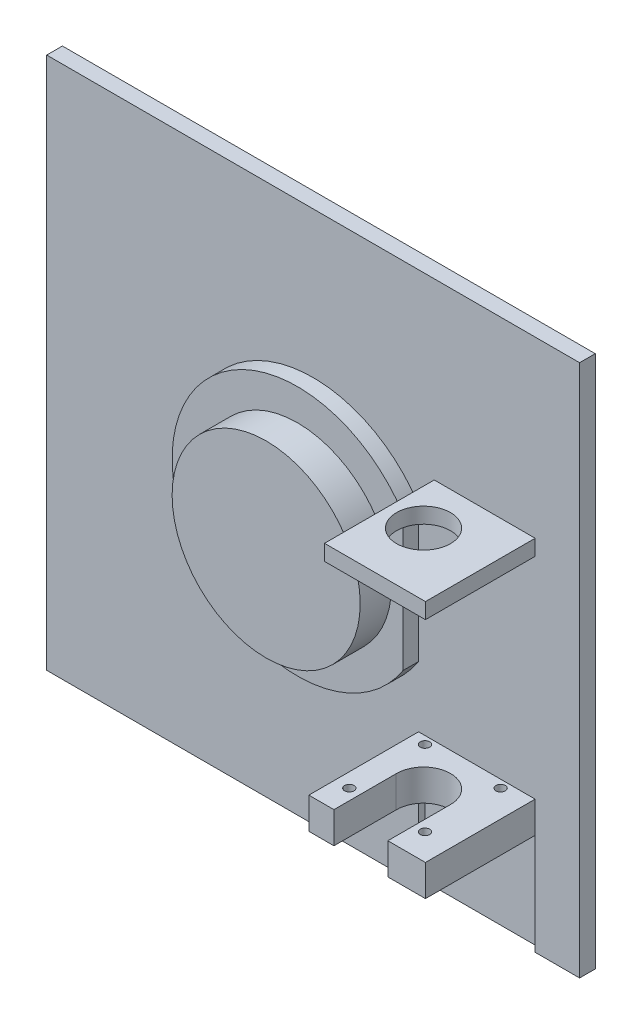
ISO-10303-21;
HEADER;
FILE_DESCRIPTION(('STEP AP214'),'2;1');
FILE_NAME('part.step','',(''),(''),'','','');
FILE_SCHEMA(('AUTOMOTIVE_DESIGN { 1 0 10303 214 1 1 1 1 }'));
ENDSEC;
DATA;
#1=APPLICATION_CONTEXT('core data for automotive mechanical design processes');
#2=APPLICATION_PROTOCOL_DEFINITION('international standard','automotive_design',2000,#1);
#3=PRODUCT_CONTEXT('',#1,'mechanical');
#4=PRODUCT('Part','Part','',(#3));
#5=PRODUCT_RELATED_PRODUCT_CATEGORY('part','',(#4));
#6=PRODUCT_DEFINITION_FORMATION('','',#4);
#7=PRODUCT_DEFINITION_CONTEXT('part definition',#1,'design');
#8=PRODUCT_DEFINITION('design','',#6,#7);
#9=PRODUCT_DEFINITION_SHAPE('','',#8);
#10=(LENGTH_UNIT() NAMED_UNIT(*) SI_UNIT(.MILLI.,.METRE.));
#11=(NAMED_UNIT(*) PLANE_ANGLE_UNIT() SI_UNIT($,.RADIAN.));
#12=(NAMED_UNIT(*) SI_UNIT($,.STERADIAN.) SOLID_ANGLE_UNIT());
#13=UNCERTAINTY_MEASURE_WITH_UNIT(LENGTH_MEASURE(1.E-05),#10,'distance_accuracy_value','');
#14=(GEOMETRIC_REPRESENTATION_CONTEXT(3) GLOBAL_UNCERTAINTY_ASSIGNED_CONTEXT((#13)) GLOBAL_UNIT_ASSIGNED_CONTEXT((#10,
#11,#12)) REPRESENTATION_CONTEXT('',''));
#15=CARTESIAN_POINT('',(0.,0.,0.));
#16=DIRECTION('',(0.,0.,1.));
#17=DIRECTION('',(1.,0.,0.));
#18=AXIS2_PLACEMENT_3D('',#15,#16,#17);
#19=CARTESIAN_POINT('',(0.,0.,12.7));
#20=DIRECTION('',(0.,0.,-1.));
#21=DIRECTION('',(-1.,0.,0.));
#22=AXIS2_PLACEMENT_3D('',#19,#20,#21);
#23=PLANE('',#22);
#24=CARTESIAN_POINT('',(107.95,105.927514246571,12.7));
#25=DIRECTION('',(0.,0.,-1.));
#26=DIRECTION('',(-1.,0.,0.));
#27=AXIS2_PLACEMENT_3D('',#24,#25,#26);
#28=CIRCLE('',#27,38.1);
#29=CARTESIAN_POINT('',(69.85,105.927514246571,12.7));
#30=VERTEX_POINT('',#29);
#31=EDGE_CURVE('E13',#30,#30,#28,.F.);
#32=ORIENTED_EDGE('',*,*,#31,.F.);
#33=EDGE_LOOP('',(#32));
#34=FACE_BOUND('',#33,.T.);
#35=CARTESIAN_POINT('',(107.95,105.927514246571,12.7));
#36=DIRECTION('',(0.,0.,1.));
#37=DIRECTION('',(1.,0.,0.));
#38=AXIS2_PLACEMENT_3D('',#35,#36,#37);
#39=CIRCLE('',#38,50.8);
#40=CARTESIAN_POINT('',(150.6474,133.451540718728,12.7));
#41=VERTEX_POINT('',#40);
#42=CARTESIAN_POINT('',(150.6474,78.4034877744141,12.7));
#43=VERTEX_POINT('',#42);
#44=EDGE_CURVE('E396',#41,#43,#39,.T.);
#45=ORIENTED_EDGE('',*,*,#44,.T.);
#46=DIRECTION('',(0.,-1.,0.));
#47=VECTOR('',#46,1.);
#48=CARTESIAN_POINT('',(150.6474,138.95324,12.7));
#49=LINE('',#48,#47);
#50=EDGE_CURVE('E231',#41,#43,#49,.T.);
#51=ORIENTED_EDGE('',*,*,#50,.F.);
#52=EDGE_LOOP('',(#45,#51));
#53=FACE_BOUND('',#52,.T.);
#54=ADVANCED_FACE('F46',(#34,#53),#23,.F.);
#55=CARTESIAN_POINT('',(0.,0.,12.7));
#56=DIRECTION('',(0.,1.,0.));
#57=DIRECTION('',(0.,0.,1.));
#58=AXIS2_PLACEMENT_3D('',#55,#56,#57);
#59=PLANE('',#58);
#60=DIRECTION('',(1.,0.,0.));
#61=VECTOR('',#60,1.);
#62=CARTESIAN_POINT('',(0.,0.,6.35));
#63=LINE('',#62,#61);
#64=CARTESIAN_POINT('',(0.,0.,6.35));
#65=VERTEX_POINT('',#64);
#66=CARTESIAN_POINT('',(150.6474,0.,6.35));
#67=VERTEX_POINT('',#66);
#68=EDGE_CURVE('E389',#65,#67,#63,.T.);
#69=ORIENTED_EDGE('',*,*,#68,.F.);
#70=DIRECTION('',(0.,0.,-1.));
#71=VECTOR('',#70,1.);
#72=CARTESIAN_POINT('',(0.,0.,12.7));
#73=LINE('',#72,#71);
#74=CARTESIAN_POINT('',(0.,0.,0.));
#75=VERTEX_POINT('',#74);
#76=EDGE_CURVE('E333',#65,#75,#73,.T.);
#77=ORIENTED_EDGE('',*,*,#76,.T.);
#78=DIRECTION('',(1.,0.,0.));
#79=VECTOR('',#78,1.);
#80=CARTESIAN_POINT('',(0.,0.,0.));
#81=LINE('',#80,#79);
#82=CARTESIAN_POINT('',(215.9,0.,0.));
#83=VERTEX_POINT('',#82);
#84=EDGE_CURVE('E318',#75,#83,#81,.T.);
#85=ORIENTED_EDGE('',*,*,#84,.T.);
#86=DIRECTION('',(0.,0.,-1.));
#87=VECTOR('',#86,1.);
#88=CARTESIAN_POINT('',(215.9,0.,12.7));
#89=LINE('',#88,#87);
#90=CARTESIAN_POINT('',(215.9,0.,6.35));
#91=VERTEX_POINT('',#90);
#92=EDGE_CURVE('E331',#91,#83,#89,.T.);
#93=ORIENTED_EDGE('',*,*,#92,.F.);
#94=DIRECTION('',(1.,0.,0.));
#95=VECTOR('',#94,1.);
#96=CARTESIAN_POINT('',(0.,0.,6.35));
#97=LINE('',#96,#95);
#98=CARTESIAN_POINT('',(197.8914,0.,6.35));
#99=VERTEX_POINT('',#98);
#100=EDGE_CURVE('E484',#99,#91,#97,.T.);
#101=ORIENTED_EDGE('',*,*,#100,.F.);
#102=DIRECTION('',(0.,0.,1.));
#103=VECTOR('',#102,1.);
#104=CARTESIAN_POINT('',(197.8914,0.,3.81));
#105=LINE('',#104,#103);
#106=CARTESIAN_POINT('',(197.8914,0.,3.81));
#107=VERTEX_POINT('',#106);
#108=EDGE_CURVE('E286',#107,#99,#105,.T.);
#109=ORIENTED_EDGE('',*,*,#108,.F.);
#110=DIRECTION('',(1.,0.,0.));
#111=VECTOR('',#110,1.);
#112=CARTESIAN_POINT('',(0.,0.,3.81));
#113=LINE('',#112,#111);
#114=CARTESIAN_POINT('',(150.6474,0.,3.81));
#115=VERTEX_POINT('',#114);
#116=EDGE_CURVE('E276',#115,#107,#113,.T.);
#117=ORIENTED_EDGE('',*,*,#116,.F.);
#118=DIRECTION('',(0.,0.,1.));
#119=VECTOR('',#118,1.);
#120=CARTESIAN_POINT('',(150.6474,0.,3.81));
#121=LINE('',#120,#119);
#122=EDGE_CURVE('E289',#115,#67,#121,.T.);
#123=ORIENTED_EDGE('',*,*,#122,.T.);
#124=EDGE_LOOP('',(#69,#77,#85,#93,#101,#109,#117,#123));
#125=FACE_BOUND('',#124,.T.);
#126=ADVANCED_FACE('F449',(#125),#59,.F.);
#127=CARTESIAN_POINT('',(0.,0.,12.7));
#128=DIRECTION('',(1.,0.,0.));
#129=DIRECTION('',(0.,0.,-1.));
#130=AXIS2_PLACEMENT_3D('',#127,#128,#129);
#131=PLANE('',#130);
#132=DIRECTION('',(0.,-1.,0.));
#133=VECTOR('',#132,1.);
#134=CARTESIAN_POINT('',(0.,0.,6.35));
#135=LINE('',#134,#133);
#136=CARTESIAN_POINT('',(0.,215.9,6.35));
#137=VERTEX_POINT('',#136);
#138=EDGE_CURVE('E392',#137,#65,#135,.T.);
#139=ORIENTED_EDGE('',*,*,#138,.F.);
#140=DIRECTION('',(0.,0.,-1.));
#141=VECTOR('',#140,1.);
#142=CARTESIAN_POINT('',(0.,215.9,12.7));
#143=LINE('',#142,#141);
#144=CARTESIAN_POINT('',(0.,215.9,0.));
#145=VERTEX_POINT('',#144);
#146=EDGE_CURVE('E327',#137,#145,#143,.T.);
#147=ORIENTED_EDGE('',*,*,#146,.T.);
#148=DIRECTION('',(0.,-1.,0.));
#149=VECTOR('',#148,1.);
#150=CARTESIAN_POINT('',(0.,0.,0.));
#151=LINE('',#150,#149);
#152=EDGE_CURVE('E315',#145,#75,#151,.T.);
#153=ORIENTED_EDGE('',*,*,#152,.T.);
#154=ORIENTED_EDGE('',*,*,#76,.F.);
#155=EDGE_LOOP('',(#139,#147,#153,#154));
#156=FACE_BOUND('',#155,.T.);
#157=ADVANCED_FACE('F48',(#156),#131,.F.);
#158=CARTESIAN_POINT('',(215.9,0.,12.7));
#159=DIRECTION('',(-1.,0.,0.));
#160=DIRECTION('',(0.,0.,1.));
#161=AXIS2_PLACEMENT_3D('',#158,#159,#160);
#162=PLANE('',#161);
#163=DIRECTION('',(0.,1.,0.));
#164=VECTOR('',#163,1.);
#165=CARTESIAN_POINT('',(215.9,0.,6.35));
#166=LINE('',#165,#164);
#167=CARTESIAN_POINT('',(215.9,215.9,6.35));
#168=VERTEX_POINT('',#167);
#169=EDGE_CURVE('E486',#91,#168,#166,.T.);
#170=ORIENTED_EDGE('',*,*,#169,.F.);
#171=ORIENTED_EDGE('',*,*,#92,.T.);
#172=DIRECTION('',(0.,1.,0.));
#173=VECTOR('',#172,1.);
#174=CARTESIAN_POINT('',(215.9,0.,0.));
#175=LINE('',#174,#173);
#176=CARTESIAN_POINT('',(215.9,215.9,0.));
#177=VERTEX_POINT('',#176);
#178=EDGE_CURVE('E321',#83,#177,#175,.T.);
#179=ORIENTED_EDGE('',*,*,#178,.T.);
#180=DIRECTION('',(0.,0.,-1.));
#181=VECTOR('',#180,1.);
#182=CARTESIAN_POINT('',(215.9,215.9,12.7));
#183=LINE('',#182,#181);
#184=EDGE_CURVE('E329',#168,#177,#183,.T.);
#185=ORIENTED_EDGE('',*,*,#184,.F.);
#186=EDGE_LOOP('',(#170,#171,#179,#185));
#187=FACE_BOUND('',#186,.T.);
#188=ADVANCED_FACE('F505',(#187),#162,.F.);
#189=CARTESIAN_POINT('',(0.,215.9,12.7));
#190=DIRECTION('',(0.,-1.,0.));
#191=DIRECTION('',(0.,0.,-1.));
#192=AXIS2_PLACEMENT_3D('',#189,#190,#191);
#193=PLANE('',#192);
#194=DIRECTION('',(-1.,0.,0.));
#195=VECTOR('',#194,1.);
#196=CARTESIAN_POINT('',(0.,215.9,6.35));
#197=LINE('',#196,#195);
#198=EDGE_CURVE('E488',#168,#137,#197,.T.);
#199=ORIENTED_EDGE('',*,*,#198,.F.);
#200=ORIENTED_EDGE('',*,*,#184,.T.);
#201=DIRECTION('',(-1.,0.,0.));
#202=VECTOR('',#201,1.);
#203=CARTESIAN_POINT('',(0.,215.9,0.));
#204=LINE('',#203,#202);
#205=EDGE_CURVE('E324',#177,#145,#204,.T.);
#206=ORIENTED_EDGE('',*,*,#205,.T.);
#207=ORIENTED_EDGE('',*,*,#146,.F.);
#208=EDGE_LOOP('',(#199,#200,#206,#207));
#209=FACE_BOUND('',#208,.T.);
#210=ADVANCED_FACE('F508',(#209),#193,.F.);
#211=CARTESIAN_POINT('',(197.8914,0.,3.81));
#212=DIRECTION('',(-1.,0.,0.));
#213=DIRECTION('',(0.,0.,1.));
#214=AXIS2_PLACEMENT_3D('',#211,#212,#213);
#215=PLANE('',#214);
#216=ORIENTED_EDGE('',*,*,#108,.T.);
#217=DIRECTION('',(0.,-1.,0.));
#218=VECTOR('',#217,1.);
#219=CARTESIAN_POINT('',(197.8914,0.,6.35));
#220=LINE('',#219,#218);
#221=CARTESIAN_POINT('',(197.8914,41.0616399999998,6.35));
#222=VERTEX_POINT('',#221);
#223=EDGE_CURVE('E385',#222,#99,#220,.T.);
#224=ORIENTED_EDGE('',*,*,#223,.F.);
#225=DIRECTION('',(0.,0.,1.));
#226=VECTOR('',#225,1.);
#227=CARTESIAN_POINT('',(197.8914,41.0616399999998,3.81));
#228=LINE('',#227,#226);
#229=CARTESIAN_POINT('',(197.8914,41.0616399999998,3.81));
#230=VERTEX_POINT('',#229);
#231=EDGE_CURVE('E282',#230,#222,#228,.T.);
#232=ORIENTED_EDGE('',*,*,#231,.F.);
#233=DIRECTION('',(0.,-1.,0.));
#234=VECTOR('',#233,1.);
#235=CARTESIAN_POINT('',(197.8914,0.,3.81));
#236=LINE('',#235,#234);
#237=EDGE_CURVE('E279',#230,#107,#236,.T.);
#238=ORIENTED_EDGE('',*,*,#237,.T.);
#239=EDGE_LOOP('',(#216,#224,#232,#238));
#240=FACE_BOUND('',#239,.T.);
#241=ADVANCED_FACE('F510',(#240),#215,.T.);
#242=CARTESIAN_POINT('',(150.6474,0.,3.81));
#243=DIRECTION('',(-1.,0.,0.));
#244=DIRECTION('',(0.,0.,1.));
#245=AXIS2_PLACEMENT_3D('',#242,#243,#244);
#246=PLANE('',#245);
#247=DIRECTION('',(0.,1.,0.));
#248=VECTOR('',#247,1.);
#249=CARTESIAN_POINT('',(150.6474,0.,6.35));
#250=LINE('',#249,#248);
#251=CARTESIAN_POINT('',(150.6474,41.0616399999998,6.35));
#252=VERTEX_POINT('',#251);
#253=EDGE_CURVE('E388',#67,#252,#250,.T.);
#254=ORIENTED_EDGE('',*,*,#253,.F.);
#255=ORIENTED_EDGE('',*,*,#122,.F.);
#256=DIRECTION('',(0.,-1.,0.));
#257=VECTOR('',#256,1.);
#258=CARTESIAN_POINT('',(150.6474,0.,3.81));
#259=LINE('',#258,#257);
#260=CARTESIAN_POINT('',(150.6474,41.0616399999998,3.81));
#261=VERTEX_POINT('',#260);
#262=EDGE_CURVE('E273',#261,#115,#259,.T.);
#263=ORIENTED_EDGE('',*,*,#262,.F.);
#264=DIRECTION('',(0.,0.,1.));
#265=VECTOR('',#264,1.);
#266=CARTESIAN_POINT('',(150.6474,41.0616399999998,3.81));
#267=LINE('',#266,#265);
#268=EDGE_CURVE('E281',#261,#252,#267,.T.);
#269=ORIENTED_EDGE('',*,*,#268,.T.);
#270=EDGE_LOOP('',(#254,#255,#263,#269));
#271=FACE_BOUND('',#270,.T.);
#272=ADVANCED_FACE('F516',(#271),#246,.F.);
#273=CARTESIAN_POINT('',(150.6474,138.95324,6.35));
#274=DIRECTION('',(-1.,0.,0.));
#275=DIRECTION('',(0.,0.,1.));
#276=AXIS2_PLACEMENT_3D('',#273,#274,#275);
#277=PLANE('',#276);
#278=DIRECTION('',(0.,0.,1.));
#279=VECTOR('',#278,1.);
#280=CARTESIAN_POINT('',(150.6474,78.4034877744141,6.35));
#281=LINE('',#280,#279);
#282=CARTESIAN_POINT('',(150.6474,78.4034877744141,6.35));
#283=VERTEX_POINT('',#282);
#284=EDGE_CURVE('E401',#283,#43,#281,.T.);
#285=ORIENTED_EDGE('',*,*,#284,.F.);
#286=DIRECTION('',(0.,-1.,0.));
#287=VECTOR('',#286,1.);
#288=CARTESIAN_POINT('',(150.6474,138.95324,6.35));
#289=LINE('',#288,#287);
#290=CARTESIAN_POINT('',(150.6474,133.451540718728,6.35));
#291=VERTEX_POINT('',#290);
#292=EDGE_CURVE('E227',#291,#283,#289,.T.);
#293=ORIENTED_EDGE('',*,*,#292,.F.);
#294=DIRECTION('',(0.,0.,1.));
#295=VECTOR('',#294,1.);
#296=CARTESIAN_POINT('',(150.6474,133.451540718728,6.35));
#297=LINE('',#296,#295);
#298=EDGE_CURVE('E391',#291,#41,#297,.T.);
#299=ORIENTED_EDGE('',*,*,#298,.T.);
#300=ORIENTED_EDGE('',*,*,#50,.T.);
#301=EDGE_LOOP('',(#285,#293,#299,#300));
#302=FACE_BOUND('',#301,.T.);
#303=ADVANCED_FACE('F443',(#302),#277,.F.);
#304=CARTESIAN_POINT('',(0.,0.,50.8));
#305=DIRECTION('',(0.,0.,1.));
#306=DIRECTION('',(1.,0.,0.));
#307=AXIS2_PLACEMENT_3D('',#304,#305,#306);
#308=PLANE('',#307);
#309=DIRECTION('',(0.,-1.,0.));
#310=VECTOR('',#309,1.);
#311=CARTESIAN_POINT('',(160.812004433932,79.1616399999998,50.8));
#312=LINE('',#311,#310);
#313=CARTESIAN_POINT('',(160.812004433932,53.7616399999999,50.8));
#314=VERTEX_POINT('',#313);
#315=CARTESIAN_POINT('',(160.812004433932,41.0616399999998,50.8));
#316=VERTEX_POINT('',#315);
#317=EDGE_CURVE('E240',#314,#316,#312,.T.);
#318=ORIENTED_EDGE('',*,*,#317,.F.);
#319=DIRECTION('',(1.,0.,0.));
#320=VECTOR('',#319,1.);
#321=CARTESIAN_POINT('',(150.6474,53.7616399999998,50.8));
#322=LINE('',#321,#320);
#323=CARTESIAN_POINT('',(150.6474,53.7616399999998,50.8));
#324=VERTEX_POINT('',#323);
#325=EDGE_CURVE('E301',#324,#314,#322,.T.);
#326=ORIENTED_EDGE('',*,*,#325,.F.);
#327=DIRECTION('',(0.,1.,0.));
#328=VECTOR('',#327,1.);
#329=CARTESIAN_POINT('',(150.6474,41.0616399999998,50.8));
#330=LINE('',#329,#328);
#331=CARTESIAN_POINT('',(150.6474,41.0616399999998,50.8));
#332=VERTEX_POINT('',#331);
#333=EDGE_CURVE('E304',#332,#324,#330,.T.);
#334=ORIENTED_EDGE('',*,*,#333,.F.);
#335=DIRECTION('',(1.,0.,0.));
#336=VECTOR('',#335,1.);
#337=CARTESIAN_POINT('',(174.2694,41.0616399999998,50.8));
#338=LINE('',#337,#336);
#339=EDGE_CURVE('E294',#332,#316,#338,.T.);
#340=ORIENTED_EDGE('',*,*,#339,.T.);
#341=EDGE_LOOP('',(#318,#326,#334,#340));
#342=FACE_BOUND('',#341,.T.);
#343=ADVANCED_FACE('F356',(#342),#308,.T.);
#344=DIRECTION('',(0.,-1.,0.));
#345=VECTOR('',#344,1.);
#346=CARTESIAN_POINT('',(156.9974,145.30324,12.7));
#347=LINE('',#346,#345);
#348=CARTESIAN_POINT('',(156.9974,145.30324,12.7));
#349=VERTEX_POINT('',#348);
#350=CARTESIAN_POINT('',(156.9974,138.95324,12.7));
#351=VERTEX_POINT('',#350);
#352=EDGE_CURVE('E435',#349,#351,#347,.T.);
#353=ORIENTED_EDGE('',*,*,#352,.F.);
#354=DIRECTION('',(0.707106781186549,0.707106781186546,0.));
#355=VECTOR('',#354,1.);
#356=CARTESIAN_POINT('',(5.84707999999969,-5.84707999999972,12.7));
#357=LINE('',#356,#355);
#358=CARTESIAN_POINT('',(150.6474,138.95324,12.7));
#359=VERTEX_POINT('',#358);
#360=EDGE_CURVE('E399',#359,#349,#357,.T.);
#361=ORIENTED_EDGE('',*,*,#360,.F.);
#362=DIRECTION('',(-1.,0.,0.));
#363=VECTOR('',#362,1.);
#364=CARTESIAN_POINT('',(156.9974,138.95324,12.7));
#365=LINE('',#364,#363);
#366=EDGE_CURVE('E217',#351,#359,#365,.T.);
#367=ORIENTED_EDGE('',*,*,#366,.F.);
#368=EDGE_LOOP('',(#353,#361,#367));
#369=FACE_BOUND('',#368,.T.);
#370=ADVANCED_FACE('F452',(#369),#23,.F.);
#371=CARTESIAN_POINT('',(0.,0.,0.));
#372=DIRECTION('',(0.,0.,-1.));
#373=DIRECTION('',(-1.,0.,0.));
#374=AXIS2_PLACEMENT_3D('',#371,#372,#373);
#375=PLANE('',#374);
#376=ORIENTED_EDGE('',*,*,#152,.F.);
#377=ORIENTED_EDGE('',*,*,#205,.F.);
#378=ORIENTED_EDGE('',*,*,#178,.F.);
#379=ORIENTED_EDGE('',*,*,#84,.F.);
#380=EDGE_LOOP('',(#376,#377,#378,#379));
#381=FACE_BOUND('',#380,.T.);
#382=ADVANCED_FACE('F461',(#381),#375,.T.);
#383=CARTESIAN_POINT('',(197.8914,41.0616399999999,50.8));
#384=DIRECTION('',(-1.,0.,0.));
#385=DIRECTION('',(0.,-1.,0.));
#386=AXIS2_PLACEMENT_3D('',#383,#384,#385);
#387=PLANE('',#386);
#388=DIRECTION('',(0.,0.,-1.));
#389=VECTOR('',#388,1.);
#390=CARTESIAN_POINT('',(197.8914,41.0616399999999,50.8));
#391=LINE('',#390,#389);
#392=CARTESIAN_POINT('',(197.8914,41.0616399999999,50.8));
#393=VERTEX_POINT('',#392);
#394=EDGE_CURVE('E313',#393,#222,#391,.T.);
#395=ORIENTED_EDGE('',*,*,#394,.T.);
#396=CARTESIAN_POINT('',(197.8914,53.7616399999999,6.35));
#397=VERTEX_POINT('',#396);
#398=EDGE_CURVE('E381',#397,#222,#220,.T.);
#399=ORIENTED_EDGE('',*,*,#398,.F.);
#400=DIRECTION('',(0.,0.,-1.));
#401=VECTOR('',#400,1.);
#402=CARTESIAN_POINT('',(197.8914,53.7616399999999,50.8));
#403=LINE('',#402,#401);
#404=CARTESIAN_POINT('',(197.8914,53.7616399999999,50.8));
#405=VERTEX_POINT('',#404);
#406=EDGE_CURVE('E311',#405,#397,#403,.T.);
#407=ORIENTED_EDGE('',*,*,#406,.F.);
#408=DIRECTION('',(0.,1.,0.));
#409=VECTOR('',#408,1.);
#410=CARTESIAN_POINT('',(197.8914,41.0616399999999,50.8));
#411=LINE('',#410,#409);
#412=EDGE_CURVE('E297',#393,#405,#411,.T.);
#413=ORIENTED_EDGE('',*,*,#412,.F.);
#414=EDGE_LOOP('',(#395,#399,#407,#413));
#415=FACE_BOUND('',#414,.T.);
#416=ADVANCED_FACE('F382',(#415),#387,.F.);
#417=CARTESIAN_POINT('',(150.6474,53.7616399999998,50.8));
#418=DIRECTION('',(0.,1.,0.));
#419=DIRECTION('',(-1.,0.,0.));
#420=AXIS2_PLACEMENT_3D('',#417,#418,#419);
#421=PLANE('',#420);
#422=CARTESIAN_POINT('',(187.059676396203,53.7616399999998,40.1562237012513));
#423=DIRECTION('',(0.,-1.,0.));
#424=DIRECTION('',(0.,0.,-1.));
#425=AXIS2_PLACEMENT_3D('',#422,#423,#424);
#426=CIRCLE('',#425,1.90499999999999);
#427=CARTESIAN_POINT('',(187.059676396203,53.7616399999998,38.2512237012513));
#428=VERTEX_POINT('',#427);
#429=EDGE_CURVE('E413',#428,#428,#426,.T.);
#430=ORIENTED_EDGE('',*,*,#429,.T.);
#431=EDGE_LOOP('',(#430));
#432=FACE_BOUND('',#431,.T.);
#433=CARTESIAN_POINT('',(156.401876396203,53.7616399999998,9.49842370125133));
#434=DIRECTION('',(0.,-1.,0.));
#435=DIRECTION('',(0.,0.,-1.));
#436=AXIS2_PLACEMENT_3D('',#433,#434,#435);
#437=CIRCLE('',#436,1.90499999999999);
#438=CARTESIAN_POINT('',(156.401876396203,53.7616399999998,7.59342370125134));
#439=VERTEX_POINT('',#438);
#440=EDGE_CURVE('E420',#439,#439,#437,.T.);
#441=ORIENTED_EDGE('',*,*,#440,.T.);
#442=EDGE_LOOP('',(#441));
#443=FACE_BOUND('',#442,.T.);
#444=CARTESIAN_POINT('',(187.059676396203,53.7616399999998,9.49842370125133));
#445=DIRECTION('',(0.,-1.,0.));
#446=DIRECTION('',(0.,0.,-1.));
#447=AXIS2_PLACEMENT_3D('',#444,#445,#446);
#448=CIRCLE('',#447,1.90499999999999);
#449=CARTESIAN_POINT('',(187.059676396203,53.7616399999998,7.59342370125133));
#450=VERTEX_POINT('',#449);
#451=EDGE_CURVE('E407',#450,#450,#448,.T.);
#452=ORIENTED_EDGE('',*,*,#451,.T.);
#453=EDGE_LOOP('',(#452));
#454=FACE_BOUND('',#453,.T.);
#455=CARTESIAN_POINT('',(156.401876396203,53.7616399999998,40.1562237012513));
#456=DIRECTION('',(0.,-1.,0.));
#457=DIRECTION('',(0.,0.,-1.));
#458=AXIS2_PLACEMENT_3D('',#455,#456,#457);
#459=CIRCLE('',#458,1.90499999999999);
#460=CARTESIAN_POINT('',(156.401876396203,53.7616399999998,38.2512237012513));
#461=VERTEX_POINT('',#460);
#462=EDGE_CURVE('E425',#461,#461,#459,.T.);
#463=ORIENTED_EDGE('',*,*,#462,.T.);
#464=EDGE_LOOP('',(#463));
#465=FACE_BOUND('',#464,.T.);
#466=DIRECTION('',(0.,0.,1.));
#467=VECTOR('',#466,1.);
#468=CARTESIAN_POINT('',(160.812004433932,53.7616399999999,50.8));
#469=LINE('',#468,#467);
#470=CARTESIAN_POINT('',(160.812004433932,53.7616399999998,25.6770474025024));
#471=VERTEX_POINT('',#470);
#472=EDGE_CURVE('E246',#471,#314,#469,.T.);
#473=ORIENTED_EDGE('',*,*,#472,.F.);
#474=CARTESIAN_POINT('',(171.730776396203,53.7616399999999,25.4115237012513));
#475=DIRECTION('',(0.,1.,0.));
#476=DIRECTION('',(-1.,0.,0.));
#477=AXIS2_PLACEMENT_3D('',#474,#475,#476);
#478=CIRCLE('',#477,10.922);
#479=CARTESIAN_POINT('',(182.649548358474,53.7616399999999,25.6770474025024));
#480=VERTEX_POINT('',#479);
#481=EDGE_CURVE('E255',#480,#471,#478,.T.);
#482=ORIENTED_EDGE('',*,*,#481,.F.);
#483=DIRECTION('',(0.,0.,-1.));
#484=VECTOR('',#483,1.);
#485=CARTESIAN_POINT('',(182.649548358474,53.7616399999999,50.8));
#486=LINE('',#485,#484);
#487=CARTESIAN_POINT('',(182.649548358474,53.7616399999999,50.8));
#488=VERTEX_POINT('',#487);
#489=EDGE_CURVE('E242',#488,#480,#486,.T.);
#490=ORIENTED_EDGE('',*,*,#489,.F.);
#491=EDGE_CURVE('E300',#488,#405,#322,.T.);
#492=ORIENTED_EDGE('',*,*,#491,.T.);
#493=ORIENTED_EDGE('',*,*,#406,.T.);
#494=DIRECTION('',(1.,0.,0.));
#495=VECTOR('',#494,1.);
#496=CARTESIAN_POINT('',(150.6474,53.7616399999999,6.35));
#497=LINE('',#496,#495);
#498=CARTESIAN_POINT('',(150.6474,53.7616399999999,6.35));
#499=VERTEX_POINT('',#498);
#500=EDGE_CURVE('E224',#499,#397,#497,.T.);
#501=ORIENTED_EDGE('',*,*,#500,.F.);
#502=DIRECTION('',(0.,0.,-1.));
#503=VECTOR('',#502,1.);
#504=CARTESIAN_POINT('',(150.6474,53.7616399999998,50.8));
#505=LINE('',#504,#503);
#506=EDGE_CURVE('E309',#324,#499,#505,.T.);
#507=ORIENTED_EDGE('',*,*,#506,.F.);
#508=ORIENTED_EDGE('',*,*,#325,.T.);
#509=EDGE_LOOP('',(#473,#482,#490,#492,#493,#501,#507,#508));
#510=FACE_BOUND('',#509,.T.);
#511=ADVANCED_FACE('F350',(#432,#443,#454,#465,#510),#421,.T.);
#512=CARTESIAN_POINT('',(150.6474,41.0616399999998,50.8));
#513=DIRECTION('',(-1.,0.,0.));
#514=DIRECTION('',(0.,-1.,0.));
#515=AXIS2_PLACEMENT_3D('',#512,#513,#514);
#516=PLANE('',#515);
#517=ORIENTED_EDGE('',*,*,#506,.T.);
#518=EDGE_CURVE('E362',#252,#499,#250,.T.);
#519=ORIENTED_EDGE('',*,*,#518,.F.);
#520=DIRECTION('',(0.,0.,-1.));
#521=VECTOR('',#520,1.);
#522=CARTESIAN_POINT('',(150.6474,41.0616399999998,50.8));
#523=LINE('',#522,#521);
#524=EDGE_CURVE('E307',#332,#252,#523,.T.);
#525=ORIENTED_EDGE('',*,*,#524,.F.);
#526=ORIENTED_EDGE('',*,*,#333,.T.);
#527=EDGE_LOOP('',(#517,#519,#525,#526));
#528=FACE_BOUND('',#527,.T.);
#529=ADVANCED_FACE('F359',(#528),#516,.T.);
#530=CARTESIAN_POINT('',(174.2694,41.0616399999998,50.8));
#531=DIRECTION('',(0.,-1.,0.));
#532=DIRECTION('',(0.,0.,-1.));
#533=AXIS2_PLACEMENT_3D('',#530,#531,#532);
#534=PLANE('',#533);
#535=CARTESIAN_POINT('',(187.059676396203,41.0616399999998,40.1562237012513));
#536=DIRECTION('',(0.,-1.,0.));
#537=DIRECTION('',(0.,0.,-1.));
#538=AXIS2_PLACEMENT_3D('',#535,#536,#537);
#539=CIRCLE('',#538,1.90499999999999);
#540=CARTESIAN_POINT('',(187.059676396203,41.0616399999998,38.2512237012513));
#541=VERTEX_POINT('',#540);
#542=EDGE_CURVE('E417',#541,#541,#539,.T.);
#543=ORIENTED_EDGE('',*,*,#542,.F.);
#544=EDGE_LOOP('',(#543));
#545=FACE_BOUND('',#544,.T.);
#546=CARTESIAN_POINT('',(156.401876396203,41.0616399999998,9.49842370125133));
#547=DIRECTION('',(0.,-1.,0.));
#548=DIRECTION('',(0.,0.,-1.));
#549=AXIS2_PLACEMENT_3D('',#546,#547,#548);
#550=CIRCLE('',#549,1.90499999999999);
#551=CARTESIAN_POINT('',(156.401876396203,41.0616399999998,7.59342370125134));
#552=VERTEX_POINT('',#551);
#553=EDGE_CURVE('E410',#552,#552,#550,.T.);
#554=ORIENTED_EDGE('',*,*,#553,.F.);
#555=EDGE_LOOP('',(#554));
#556=FACE_BOUND('',#555,.T.);
#557=CARTESIAN_POINT('',(187.059676396203,41.0616399999998,9.49842370125133));
#558=DIRECTION('',(0.,-1.,0.));
#559=DIRECTION('',(0.,0.,-1.));
#560=AXIS2_PLACEMENT_3D('',#557,#558,#559);
#561=CIRCLE('',#560,1.90499999999999);
#562=CARTESIAN_POINT('',(187.059676396203,41.0616399999998,7.59342370125133));
#563=VERTEX_POINT('',#562);
#564=EDGE_CURVE('E403',#563,#563,#561,.T.);
#565=ORIENTED_EDGE('',*,*,#564,.F.);
#566=EDGE_LOOP('',(#565));
#567=FACE_BOUND('',#566,.T.);
#568=CARTESIAN_POINT('',(156.401876396203,41.0616399999998,40.1562237012513));
#569=DIRECTION('',(0.,-1.,0.));
#570=DIRECTION('',(0.,0.,-1.));
#571=AXIS2_PLACEMENT_3D('',#568,#569,#570);
#572=CIRCLE('',#571,1.90499999999999);
#573=CARTESIAN_POINT('',(156.401876396203,41.0616399999998,38.2512237012513));
#574=VERTEX_POINT('',#573);
#575=EDGE_CURVE('E416',#574,#574,#572,.T.);
#576=ORIENTED_EDGE('',*,*,#575,.F.);
#577=EDGE_LOOP('',(#576));
#578=FACE_BOUND('',#577,.T.);
#579=DIRECTION('',(0.,0.,-1.));
#580=VECTOR('',#579,1.);
#581=CARTESIAN_POINT('',(160.812004433932,41.0616399999998,25.146));
#582=LINE('',#581,#580);
#583=CARTESIAN_POINT('',(160.812004433932,41.0616399999998,25.6770474025024));
#584=VERTEX_POINT('',#583);
#585=EDGE_CURVE('E236',#316,#584,#582,.T.);
#586=ORIENTED_EDGE('',*,*,#585,.F.);
#587=ORIENTED_EDGE('',*,*,#339,.F.);
#588=ORIENTED_EDGE('',*,*,#524,.T.);
#589=ORIENTED_EDGE('',*,*,#268,.F.);
#590=DIRECTION('',(-1.,0.,0.));
#591=VECTOR('',#590,1.);
#592=CARTESIAN_POINT('',(0.,41.0616399999998,3.81));
#593=LINE('',#592,#591);
#594=EDGE_CURVE('E270',#230,#261,#593,.T.);
#595=ORIENTED_EDGE('',*,*,#594,.F.);
#596=ORIENTED_EDGE('',*,*,#231,.T.);
#597=ORIENTED_EDGE('',*,*,#394,.F.);
#598=CARTESIAN_POINT('',(182.649548358474,41.0616399999998,50.8));
#599=VERTEX_POINT('',#598);
#600=EDGE_CURVE('E285',#599,#393,#338,.T.);
#601=ORIENTED_EDGE('',*,*,#600,.F.);
#602=DIRECTION('',(0.,0.,1.));
#603=VECTOR('',#602,1.);
#604=CARTESIAN_POINT('',(182.649548358474,41.0616399999998,25.146));
#605=LINE('',#604,#603);
#606=CARTESIAN_POINT('',(182.649548358474,41.0616399999998,25.6770474025024));
#607=VERTEX_POINT('',#606);
#608=EDGE_CURVE('E218',#607,#599,#605,.T.);
#609=ORIENTED_EDGE('',*,*,#608,.F.);
#610=CARTESIAN_POINT('',(171.730776396203,41.0616399999998,25.4115237012513));
#611=DIRECTION('',(0.,-1.,0.));
#612=DIRECTION('',(0.,0.,-1.));
#613=AXIS2_PLACEMENT_3D('',#610,#611,#612);
#614=CIRCLE('',#613,10.922);
#615=EDGE_CURVE('E248',#584,#607,#614,.T.);
#616=ORIENTED_EDGE('',*,*,#615,.F.);
#617=EDGE_LOOP('',(#586,#587,#588,#589,#595,#596,#597,#601,#609,#616));
#618=FACE_BOUND('',#617,.T.);
#619=ADVANCED_FACE('F365',(#545,#556,#567,#578,#618),#534,.T.);
#620=DIRECTION('',(0.,-1.,0.));
#621=VECTOR('',#620,1.);
#622=CARTESIAN_POINT('',(182.649548358474,79.1616399999998,50.8));
#623=LINE('',#622,#621);
#624=EDGE_CURVE('E239',#488,#599,#623,.T.);
#625=ORIENTED_EDGE('',*,*,#624,.T.);
#626=ORIENTED_EDGE('',*,*,#600,.T.);
#627=ORIENTED_EDGE('',*,*,#412,.T.);
#628=ORIENTED_EDGE('',*,*,#491,.F.);
#629=EDGE_LOOP('',(#625,#626,#627,#628));
#630=FACE_BOUND('',#629,.T.);
#631=ADVANCED_FACE('F375',(#630),#308,.T.);
#632=CARTESIAN_POINT('',(0.,0.,3.81));
#633=DIRECTION('',(0.,0.,1.));
#634=DIRECTION('',(1.,0.,0.));
#635=AXIS2_PLACEMENT_3D('',#632,#633,#634);
#636=PLANE('',#635);
#637=ORIENTED_EDGE('',*,*,#594,.T.);
#638=ORIENTED_EDGE('',*,*,#262,.T.);
#639=ORIENTED_EDGE('',*,*,#116,.T.);
#640=ORIENTED_EDGE('',*,*,#237,.F.);
#641=EDGE_LOOP('',(#637,#638,#639,#640));
#642=FACE_BOUND('',#641,.T.);
#643=ADVANCED_FACE('F651',(#642),#636,.T.);
#644=CARTESIAN_POINT('',(197.8914,0.,50.8));
#645=DIRECTION('',(-1.,0.,0.));
#646=DIRECTION('',(0.,0.,1.));
#647=AXIS2_PLACEMENT_3D('',#644,#645,#646);
#648=PLANE('',#647);
#649=DIRECTION('',(0.,0.,-1.));
#650=VECTOR('',#649,1.);
#651=CARTESIAN_POINT('',(197.8914,138.95324,50.8));
#652=LINE('',#651,#650);
#653=CARTESIAN_POINT('',(197.8914,138.95324,50.8));
#654=VERTEX_POINT('',#653);
#655=CARTESIAN_POINT('',(197.8914,138.95324,6.35));
#656=VERTEX_POINT('',#655);
#657=EDGE_CURVE('E266',#654,#656,#652,.T.);
#658=ORIENTED_EDGE('',*,*,#657,.T.);
#659=CARTESIAN_POINT('',(197.8914,145.30324,6.35));
#660=VERTEX_POINT('',#659);
#661=EDGE_CURVE('E223',#660,#656,#220,.T.);
#662=ORIENTED_EDGE('',*,*,#661,.F.);
#663=DIRECTION('',(0.,0.,-1.));
#664=VECTOR('',#663,1.);
#665=CARTESIAN_POINT('',(197.8914,145.30324,50.8));
#666=LINE('',#665,#664);
#667=CARTESIAN_POINT('',(197.8914,145.30324,50.8));
#668=VERTEX_POINT('',#667);
#669=EDGE_CURVE('E268',#668,#660,#666,.T.);
#670=ORIENTED_EDGE('',*,*,#669,.F.);
#671=DIRECTION('',(0.,1.,0.));
#672=VECTOR('',#671,1.);
#673=CARTESIAN_POINT('',(197.8914,0.,50.8));
#674=LINE('',#673,#672);
#675=EDGE_CURVE('E257',#654,#668,#674,.T.);
#676=ORIENTED_EDGE('',*,*,#675,.F.);
#677=EDGE_LOOP('',(#658,#662,#670,#676));
#678=FACE_BOUND('',#677,.T.);
#679=ADVANCED_FACE('F480',(#678),#648,.F.);
#680=CARTESIAN_POINT('',(0.,145.30324,50.8));
#681=DIRECTION('',(0.,-1.,0.));
#682=DIRECTION('',(0.,0.,-1.));
#683=AXIS2_PLACEMENT_3D('',#680,#681,#682);
#684=PLANE('',#683);
#685=CARTESIAN_POINT('',(171.730776396203,145.30324,25.4115237012513));
#686=DIRECTION('',(0.,-1.,0.));
#687=DIRECTION('',(0.,0.,-1.));
#688=AXIS2_PLACEMENT_3D('',#685,#686,#687);
#689=CIRCLE('',#688,10.922);
#690=CARTESIAN_POINT('',(171.730776396203,145.30324,14.4895237012513));
#691=VERTEX_POINT('',#690);
#692=EDGE_CURVE('E252',#691,#691,#689,.T.);
#693=ORIENTED_EDGE('',*,*,#692,.T.);
#694=EDGE_LOOP('',(#693));
#695=FACE_BOUND('',#694,.T.);
#696=ORIENTED_EDGE('',*,*,#669,.T.);
#697=DIRECTION('',(1.,0.,0.));
#698=VECTOR('',#697,1.);
#699=CARTESIAN_POINT('',(0.,145.30324,6.35));
#700=LINE('',#699,#698);
#701=CARTESIAN_POINT('',(156.9974,145.30324,6.35));
#702=VERTEX_POINT('',#701);
#703=EDGE_CURVE('E209',#702,#660,#700,.T.);
#704=ORIENTED_EDGE('',*,*,#703,.F.);
#705=DIRECTION('',(0.,0.,1.));
#706=VECTOR('',#705,1.);
#707=CARTESIAN_POINT('',(156.9974,145.30324,6.35));
#708=LINE('',#707,#706);
#709=EDGE_CURVE('E204',#702,#349,#708,.T.);
#710=ORIENTED_EDGE('',*,*,#709,.T.);
#711=DIRECTION('',(0.,0.,-1.));
#712=VECTOR('',#711,1.);
#713=CARTESIAN_POINT('',(156.9974,145.30324,50.8));
#714=LINE('',#713,#712);
#715=CARTESIAN_POINT('',(156.9974,145.30324,50.8));
#716=VERTEX_POINT('',#715);
#717=EDGE_CURVE('E432',#716,#349,#714,.T.);
#718=ORIENTED_EDGE('',*,*,#717,.F.);
#719=DIRECTION('',(-1.,0.,0.));
#720=VECTOR('',#719,1.);
#721=CARTESIAN_POINT('',(0.,145.30324,50.8));
#722=LINE('',#721,#720);
#723=EDGE_CURVE('E260',#668,#716,#722,.T.);
#724=ORIENTED_EDGE('',*,*,#723,.F.);
#725=EDGE_LOOP('',(#696,#704,#710,#718,#724));
#726=FACE_BOUND('',#725,.T.);
#727=ADVANCED_FACE('F473',(#695,#726),#684,.F.);
#728=CARTESIAN_POINT('',(0.,138.95324,50.8));
#729=DIRECTION('',(0.,-1.,0.));
#730=DIRECTION('',(1.,0.,0.));
#731=AXIS2_PLACEMENT_3D('',#728,#729,#730);
#732=PLANE('',#731);
#733=ORIENTED_EDGE('',*,*,#366,.T.);
#734=DIRECTION('',(0.,0.,1.));
#735=VECTOR('',#734,1.);
#736=CARTESIAN_POINT('',(150.6474,138.95324,6.35));
#737=LINE('',#736,#735);
#738=CARTESIAN_POINT('',(150.6474,138.95324,6.35));
#739=VERTEX_POINT('',#738);
#740=EDGE_CURVE('E202',#739,#359,#737,.T.);
#741=ORIENTED_EDGE('',*,*,#740,.F.);
#742=DIRECTION('',(-1.,0.,0.));
#743=VECTOR('',#742,1.);
#744=CARTESIAN_POINT('',(150.6474,138.95324,6.35));
#745=LINE('',#744,#743);
#746=EDGE_CURVE('E216',#656,#739,#745,.T.);
#747=ORIENTED_EDGE('',*,*,#746,.F.);
#748=ORIENTED_EDGE('',*,*,#657,.F.);
#749=DIRECTION('',(-1.,0.,0.));
#750=VECTOR('',#749,1.);
#751=CARTESIAN_POINT('',(0.,138.95324,50.8));
#752=LINE('',#751,#750);
#753=CARTESIAN_POINT('',(156.9974,138.95324,50.8));
#754=VERTEX_POINT('',#753);
#755=EDGE_CURVE('E263',#654,#754,#752,.T.);
#756=ORIENTED_EDGE('',*,*,#755,.T.);
#757=DIRECTION('',(0.,0.,1.));
#758=VECTOR('',#757,1.);
#759=CARTESIAN_POINT('',(156.9974,138.95324,50.8));
#760=LINE('',#759,#758);
#761=EDGE_CURVE('E68',#351,#754,#760,.T.);
#762=ORIENTED_EDGE('',*,*,#761,.F.);
#763=EDGE_LOOP('',(#733,#741,#747,#748,#756,#762));
#764=FACE_BOUND('',#763,.T.);
#765=CARTESIAN_POINT('',(171.730776396203,138.95324,25.4115237012513));
#766=DIRECTION('',(0.,-1.,0.));
#767=DIRECTION('',(1.,0.,0.));
#768=AXIS2_PLACEMENT_3D('',#765,#766,#767);
#769=CIRCLE('',#768,10.922);
#770=CARTESIAN_POINT('',(182.652776396203,138.95324,25.4115237012513));
#771=VERTEX_POINT('',#770);
#772=EDGE_CURVE('E251',#771,#771,#769,.T.);
#773=ORIENTED_EDGE('',*,*,#772,.F.);
#774=EDGE_LOOP('',(#773));
#775=FACE_BOUND('',#774,.T.);
#776=ADVANCED_FACE('F214',(#764,#775),#732,.T.);
#777=CARTESIAN_POINT('',(0.,0.,50.8));
#778=DIRECTION('',(0.,0.,1.));
#779=DIRECTION('',(1.,0.,0.));
#780=AXIS2_PLACEMENT_3D('',#777,#778,#779);
#781=PLANE('',#780);
#782=DIRECTION('',(0.,1.,0.));
#783=VECTOR('',#782,1.);
#784=CARTESIAN_POINT('',(156.9974,145.30324,50.8));
#785=LINE('',#784,#783);
#786=EDGE_CURVE('E428',#754,#716,#785,.T.);
#787=ORIENTED_EDGE('',*,*,#786,.F.);
#788=ORIENTED_EDGE('',*,*,#755,.F.);
#789=ORIENTED_EDGE('',*,*,#675,.T.);
#790=ORIENTED_EDGE('',*,*,#723,.T.);
#791=EDGE_LOOP('',(#787,#788,#789,#790));
#792=FACE_BOUND('',#791,.T.);
#793=ADVANCED_FACE('F475',(#792),#781,.T.);
#794=CARTESIAN_POINT('',(171.730776396203,215.9,25.4115237012513));
#795=DIRECTION('',(0.,-1.,0.));
#796=DIRECTION('',(0.,0.,-1.));
#797=AXIS2_PLACEMENT_3D('',#794,#795,#796);
#798=CYLINDRICAL_SURFACE('',#797,10.922);
#799=ORIENTED_EDGE('',*,*,#772,.T.);
#800=EDGE_LOOP('',(#799));
#801=FACE_BOUND('',#800,.T.);
#802=ORIENTED_EDGE('',*,*,#692,.F.);
#803=EDGE_LOOP('',(#802));
#804=FACE_BOUND('',#803,.T.);
#805=ADVANCED_FACE('F588',(#801,#804),#798,.F.);
#806=ORIENTED_EDGE('',*,*,#615,.T.);
#807=DIRECTION('',(0.,-1.,0.));
#808=VECTOR('',#807,1.);
#809=CARTESIAN_POINT('',(182.649548358474,215.9,25.6770474025024));
#810=LINE('',#809,#808);
#811=EDGE_CURVE('E335',#607,#480,#810,.F.);
#812=ORIENTED_EDGE('',*,*,#811,.T.);
#813=ORIENTED_EDGE('',*,*,#481,.T.);
#814=DIRECTION('',(0.,-1.,0.));
#815=VECTOR('',#814,1.);
#816=CARTESIAN_POINT('',(160.812004433932,215.9,25.6770474025024));
#817=LINE('',#816,#815);
#818=EDGE_CURVE('E54',#471,#584,#817,.T.);
#819=ORIENTED_EDGE('',*,*,#818,.T.);
#820=EDGE_LOOP('',(#806,#812,#813,#819));
#821=FACE_BOUND('',#820,.T.);
#822=ADVANCED_FACE('F342',(#821),#798,.F.);
#823=CARTESIAN_POINT('',(182.649548358474,79.1616399999998,25.146));
#824=DIRECTION('',(1.,0.,0.));
#825=DIRECTION('',(0.,0.,-1.));
#826=AXIS2_PLACEMENT_3D('',#823,#824,#825);
#827=PLANE('',#826);
#828=ORIENTED_EDGE('',*,*,#489,.T.);
#829=ORIENTED_EDGE('',*,*,#811,.F.);
#830=ORIENTED_EDGE('',*,*,#608,.T.);
#831=ORIENTED_EDGE('',*,*,#624,.F.);
#832=EDGE_LOOP('',(#828,#829,#830,#831));
#833=FACE_BOUND('',#832,.T.);
#834=ADVANCED_FACE('F372',(#833),#827,.F.);
#835=CARTESIAN_POINT('',(160.812004433932,79.1616399999998,25.146));
#836=DIRECTION('',(-1.,0.,0.));
#837=DIRECTION('',(0.,0.,1.));
#838=AXIS2_PLACEMENT_3D('',#835,#836,#837);
#839=PLANE('',#838);
#840=ORIENTED_EDGE('',*,*,#472,.T.);
#841=ORIENTED_EDGE('',*,*,#317,.T.);
#842=ORIENTED_EDGE('',*,*,#585,.T.);
#843=ORIENTED_EDGE('',*,*,#818,.F.);
#844=EDGE_LOOP('',(#840,#841,#842,#843));
#845=FACE_BOUND('',#844,.T.);
#846=ADVANCED_FACE('F346',(#845),#839,.F.);
#847=CARTESIAN_POINT('',(0.,0.,6.35));
#848=DIRECTION('',(0.,0.,1.));
#849=DIRECTION('',(1.,0.,0.));
#850=AXIS2_PLACEMENT_3D('',#847,#848,#849);
#851=PLANE('',#850);
#852=ORIENTED_EDGE('',*,*,#518,.T.);
#853=ORIENTED_EDGE('',*,*,#500,.T.);
#854=ORIENTED_EDGE('',*,*,#398,.T.);
#855=ORIENTED_EDGE('',*,*,#223,.T.);
#856=ORIENTED_EDGE('',*,*,#100,.T.);
#857=ORIENTED_EDGE('',*,*,#169,.T.);
#858=ORIENTED_EDGE('',*,*,#198,.T.);
#859=ORIENTED_EDGE('',*,*,#138,.T.);
#860=ORIENTED_EDGE('',*,*,#68,.T.);
#861=ORIENTED_EDGE('',*,*,#253,.T.);
#862=EDGE_LOOP('',(#852,#853,#854,#855,#856,#857,#858,#859,#860,#861));
#863=FACE_BOUND('',#862,.T.);
#864=ORIENTED_EDGE('',*,*,#661,.T.);
#865=ORIENTED_EDGE('',*,*,#746,.T.);
#866=DIRECTION('',(0.707106781186549,0.707106781186546,0.));
#867=VECTOR('',#866,1.);
#868=CARTESIAN_POINT('',(5.84707999999969,-5.84707999999972,6.35));
#869=LINE('',#868,#867);
#870=EDGE_CURVE('E198',#739,#702,#869,.T.);
#871=ORIENTED_EDGE('',*,*,#870,.T.);
#872=ORIENTED_EDGE('',*,*,#703,.T.);
#873=EDGE_LOOP('',(#864,#865,#871,#872));
#874=FACE_BOUND('',#873,.T.);
#875=ORIENTED_EDGE('',*,*,#292,.T.);
#876=CARTESIAN_POINT('',(107.95,105.927514246571,6.35));
#877=DIRECTION('',(0.,0.,1.));
#878=DIRECTION('',(1.,0.,0.));
#879=AXIS2_PLACEMENT_3D('',#876,#877,#878);
#880=CIRCLE('',#879,50.8);
#881=EDGE_CURVE('E60',#291,#283,#880,.T.);
#882=ORIENTED_EDGE('',*,*,#881,.F.);
#883=EDGE_LOOP('',(#875,#882));
#884=FACE_BOUND('',#883,.T.);
#885=ADVANCED_FACE('F221',(#863,#874,#884),#851,.T.);
#886=CARTESIAN_POINT('',(107.95,105.927514246571,25.4));
#887=DIRECTION('',(0.,0.,-1.));
#888=DIRECTION('',(-1.,0.,0.));
#889=AXIS2_PLACEMENT_3D('',#886,#887,#888);
#890=CYLINDRICAL_SURFACE('',#889,38.1);
#891=CARTESIAN_POINT('',(107.95,105.927514246571,25.4));
#892=DIRECTION('',(0.,0.,1.));
#893=DIRECTION('',(1.,0.,0.));
#894=AXIS2_PLACEMENT_3D('',#891,#892,#893);
#895=CIRCLE('',#894,38.1);
#896=CARTESIAN_POINT('',(146.05,105.927514246571,25.4));
#897=VERTEX_POINT('',#896);
#898=EDGE_CURVE('E233',#897,#897,#895,.T.);
#899=ORIENTED_EDGE('',*,*,#898,.F.);
#900=EDGE_LOOP('',(#899));
#901=FACE_BOUND('',#900,.T.);
#902=ORIENTED_EDGE('',*,*,#31,.T.);
#903=EDGE_LOOP('',(#902));
#904=FACE_BOUND('',#903,.T.);
#905=ADVANCED_FACE('F602',(#901,#904),#890,.T.);
#906=CARTESIAN_POINT('',(0.,0.,25.4));
#907=DIRECTION('',(0.,0.,1.));
#908=DIRECTION('',(1.,0.,0.));
#909=AXIS2_PLACEMENT_3D('',#906,#907,#908);
#910=PLANE('',#909);
#911=ORIENTED_EDGE('',*,*,#898,.T.);
#912=EDGE_LOOP('',(#911));
#913=FACE_BOUND('',#912,.T.);
#914=ADVANCED_FACE('F597',(#913),#910,.T.);
#915=CARTESIAN_POINT('',(156.9974,0.,0.));
#916=DIRECTION('',(1.,0.,0.));
#917=DIRECTION('',(0.,0.,-1.));
#918=AXIS2_PLACEMENT_3D('',#915,#916,#917);
#919=PLANE('',#918);
#920=ORIENTED_EDGE('',*,*,#786,.T.);
#921=ORIENTED_EDGE('',*,*,#717,.T.);
#922=ORIENTED_EDGE('',*,*,#352,.T.);
#923=ORIENTED_EDGE('',*,*,#761,.T.);
#924=EDGE_LOOP('',(#920,#921,#922,#923));
#925=FACE_BOUND('',#924,.T.);
#926=ADVANCED_FACE('F471',(#925),#919,.F.);
#927=CARTESIAN_POINT('',(156.401876396203,53.7616399999998,40.1562237012513));
#928=DIRECTION('',(0.,-1.,0.));
#929=DIRECTION('',(0.,0.,-1.));
#930=AXIS2_PLACEMENT_3D('',#927,#928,#929);
#931=CYLINDRICAL_SURFACE('',#930,1.90499999999999);
#932=ORIENTED_EDGE('',*,*,#462,.F.);
#933=EDGE_LOOP('',(#932));
#934=FACE_BOUND('',#933,.T.);
#935=ORIENTED_EDGE('',*,*,#575,.T.);
#936=EDGE_LOOP('',(#935));
#937=FACE_BOUND('',#936,.T.);
#938=ADVANCED_FACE('F567',(#934,#937),#931,.F.);
#939=CARTESIAN_POINT('',(187.059676396203,53.7616399999998,9.49842370125133));
#940=DIRECTION('',(0.,-1.,0.));
#941=DIRECTION('',(0.,0.,-1.));
#942=AXIS2_PLACEMENT_3D('',#939,#940,#941);
#943=CYLINDRICAL_SURFACE('',#942,1.90499999999999);
#944=ORIENTED_EDGE('',*,*,#451,.F.);
#945=EDGE_LOOP('',(#944));
#946=FACE_BOUND('',#945,.T.);
#947=ORIENTED_EDGE('',*,*,#564,.T.);
#948=EDGE_LOOP('',(#947));
#949=FACE_BOUND('',#948,.T.);
#950=ADVANCED_FACE('F557',(#946,#949),#943,.F.);
#951=CARTESIAN_POINT('',(156.401876396203,53.7616399999998,9.49842370125133));
#952=DIRECTION('',(0.,-1.,0.));
#953=DIRECTION('',(0.,0.,-1.));
#954=AXIS2_PLACEMENT_3D('',#951,#952,#953);
#955=CYLINDRICAL_SURFACE('',#954,1.90499999999999);
#956=ORIENTED_EDGE('',*,*,#440,.F.);
#957=EDGE_LOOP('',(#956));
#958=FACE_BOUND('',#957,.T.);
#959=ORIENTED_EDGE('',*,*,#553,.T.);
#960=EDGE_LOOP('',(#959));
#961=FACE_BOUND('',#960,.T.);
#962=ADVANCED_FACE('F545',(#958,#961),#955,.F.);
#963=CARTESIAN_POINT('',(187.059676396203,53.7616399999998,40.1562237012513));
#964=DIRECTION('',(0.,-1.,0.));
#965=DIRECTION('',(0.,0.,-1.));
#966=AXIS2_PLACEMENT_3D('',#963,#964,#965);
#967=CYLINDRICAL_SURFACE('',#966,1.90499999999999);
#968=ORIENTED_EDGE('',*,*,#429,.F.);
#969=EDGE_LOOP('',(#968));
#970=FACE_BOUND('',#969,.T.);
#971=ORIENTED_EDGE('',*,*,#542,.T.);
#972=EDGE_LOOP('',(#971));
#973=FACE_BOUND('',#972,.T.);
#974=ADVANCED_FACE('F540',(#970,#973),#967,.F.);
#975=CARTESIAN_POINT('',(107.95,105.927514246571,6.35));
#976=DIRECTION('',(0.,0.,1.));
#977=DIRECTION('',(1.,0.,0.));
#978=AXIS2_PLACEMENT_3D('',#975,#976,#977);
#979=CYLINDRICAL_SURFACE('',#978,50.8);
#980=ORIENTED_EDGE('',*,*,#44,.F.);
#981=ORIENTED_EDGE('',*,*,#298,.F.);
#982=ORIENTED_EDGE('',*,*,#881,.T.);
#983=ORIENTED_EDGE('',*,*,#284,.T.);
#984=EDGE_LOOP('',(#980,#981,#982,#983));
#985=FACE_BOUND('',#984,.T.);
#986=ADVANCED_FACE('F446',(#985),#979,.T.);
#987=CARTESIAN_POINT('',(5.84707999999969,-5.84707999999972,6.35));
#988=DIRECTION('',(0.707106781186546,-0.707106781186549,0.));
#989=DIRECTION('',(0.707106781186549,0.707106781186546,0.));
#990=AXIS2_PLACEMENT_3D('',#987,#988,#989);
#991=PLANE('',#990);
#992=ORIENTED_EDGE('',*,*,#360,.T.);
#993=ORIENTED_EDGE('',*,*,#709,.F.);
#994=ORIENTED_EDGE('',*,*,#870,.F.);
#995=ORIENTED_EDGE('',*,*,#740,.T.);
#996=EDGE_LOOP('',(#992,#993,#994,#995));
#997=FACE_BOUND('',#996,.T.);
#998=ADVANCED_FACE('F201',(#997),#991,.F.);
#999=CLOSED_SHELL('',(#54,#126,#157,#188,#210,#241,#272,#303,#343,#370,#382,#416,#511,#529,#619,
#631,#643,#679,#727,#776,#793,#805,#822,#834,#846,#885,#905,#914,#926,#938,#950,#962,#974,#986,#998));
#1000=MANIFOLD_SOLID_BREP('B2',#999);
#1001=ADVANCED_BREP_SHAPE_REPRESENTATION('',(#18,#1000),#14);
#1002=SHAPE_DEFINITION_REPRESENTATION(#9,#1001);
ENDSEC;
END-ISO-10303-21;
